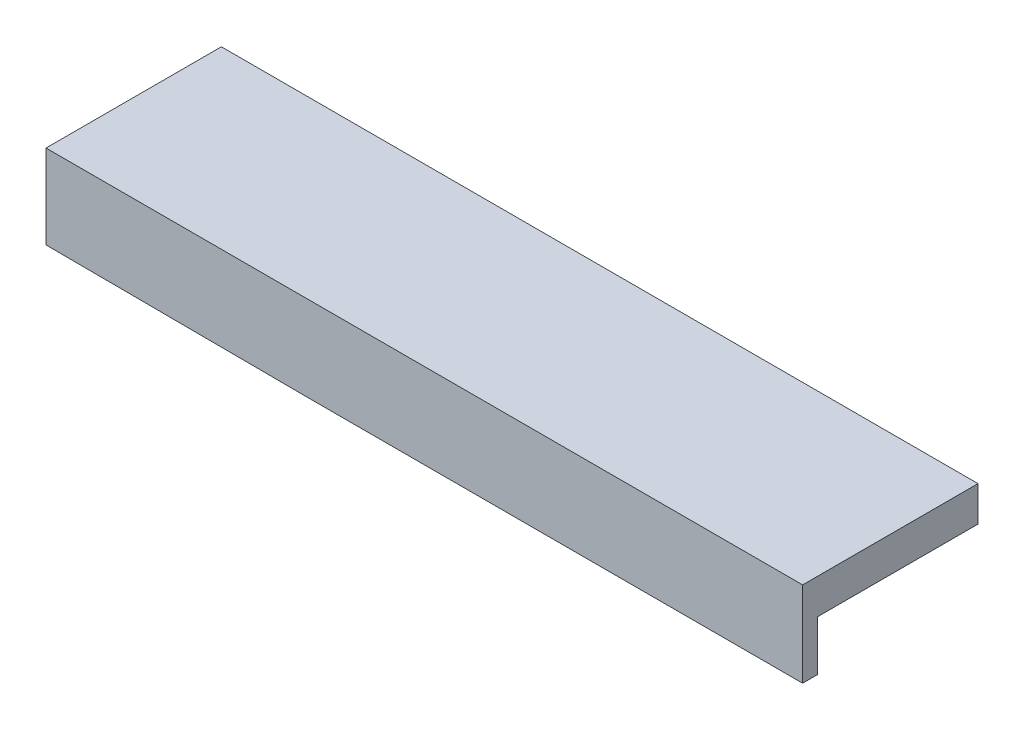
ISO-10303-21;
HEADER;
FILE_DESCRIPTION(('STEP AP214'),'2;1');
FILE_NAME('part.step','',(''),(''),'','','');
FILE_SCHEMA(('AUTOMOTIVE_DESIGN { 1 0 10303 214 1 1 1 1 }'));
ENDSEC;
DATA;
#1=APPLICATION_CONTEXT('core data for automotive mechanical design processes');
#2=APPLICATION_PROTOCOL_DEFINITION('international standard','automotive_design',2000,#1);
#3=PRODUCT_CONTEXT('',#1,'mechanical');
#4=PRODUCT('Part','Part','',(#3));
#5=PRODUCT_RELATED_PRODUCT_CATEGORY('part','',(#4));
#6=PRODUCT_DEFINITION_FORMATION('','',#4);
#7=PRODUCT_DEFINITION_CONTEXT('part definition',#1,'design');
#8=PRODUCT_DEFINITION('design','',#6,#7);
#9=PRODUCT_DEFINITION_SHAPE('','',#8);
#10=(LENGTH_UNIT() NAMED_UNIT(*) SI_UNIT(.MILLI.,.METRE.));
#11=(NAMED_UNIT(*) PLANE_ANGLE_UNIT() SI_UNIT($,.RADIAN.));
#12=(NAMED_UNIT(*) SI_UNIT($,.STERADIAN.) SOLID_ANGLE_UNIT());
#13=UNCERTAINTY_MEASURE_WITH_UNIT(LENGTH_MEASURE(1.E-05),#10,'distance_accuracy_value','');
#14=(GEOMETRIC_REPRESENTATION_CONTEXT(3) GLOBAL_UNCERTAINTY_ASSIGNED_CONTEXT((#13)) GLOBAL_UNIT_ASSIGNED_CONTEXT((#10,
#11,#12)) REPRESENTATION_CONTEXT('',''));
#15=CARTESIAN_POINT('',(0.,0.,0.));
#16=DIRECTION('',(0.,0.,1.));
#17=DIRECTION('',(1.,0.,0.));
#18=AXIS2_PLACEMENT_3D('',#15,#16,#17);
#19=CARTESIAN_POINT('',(23.15,-3.50000000000001,35.));
#20=DIRECTION('',(0.,1.,0.));
#21=DIRECTION('',(0.,0.,1.));
#22=AXIS2_PLACEMENT_3D('',#19,#20,#21);
#23=PLANE('',#22);
#24=DIRECTION('',(-1.,0.,0.));
#25=VECTOR('',#24,1.);
#26=CARTESIAN_POINT('',(85.9403065089106,-3.50000000000001,32.));
#27=LINE('',#26,#25);
#28=CARTESIAN_POINT('',(75.5,-3.50000000000001,32.));
#29=VERTEX_POINT('',#28);
#30=CARTESIAN_POINT('',(23.15,-3.50000000000001,32.));
#31=VERTEX_POINT('',#30);
#32=EDGE_CURVE('E167',#29,#31,#27,.T.);
#33=ORIENTED_EDGE('',*,*,#32,.T.);
#34=DIRECTION('',(0.,0.,-1.));
#35=VECTOR('',#34,1.);
#36=CARTESIAN_POINT('',(23.15,-3.50000000000001,35.));
#37=LINE('',#36,#35);
#38=CARTESIAN_POINT('',(23.15,-3.50000000000001,0.));
#39=VERTEX_POINT('',#38);
#40=EDGE_CURVE('E103',#31,#39,#37,.T.);
#41=ORIENTED_EDGE('',*,*,#40,.T.);
#42=DIRECTION('',(1.,0.,0.));
#43=VECTOR('',#42,1.);
#44=CARTESIAN_POINT('',(23.15,-3.50000000000001,0.));
#45=LINE('',#44,#43);
#46=CARTESIAN_POINT('',(75.5,-3.50000000000001,0.));
#47=VERTEX_POINT('',#46);
#48=EDGE_CURVE('E221',#39,#47,#45,.T.);
#49=ORIENTED_EDGE('',*,*,#48,.T.);
#50=DIRECTION('',(0.,0.,-1.));
#51=VECTOR('',#50,1.);
#52=CARTESIAN_POINT('',(75.5,-3.50000000000001,35.));
#53=LINE('',#52,#51);
#54=EDGE_CURVE('E12',#29,#47,#53,.T.);
#55=ORIENTED_EDGE('',*,*,#54,.F.);
#56=EDGE_LOOP('',(#33,#41,#49,#55));
#57=FACE_BOUND('',#56,.T.);
#58=ADVANCED_FACE('F38',(#57),#23,.F.);
#59=CARTESIAN_POINT('',(23.15,-13.5,35.));
#60=DIRECTION('',(-1.,0.,0.));
#61=DIRECTION('',(0.,0.,1.));
#62=AXIS2_PLACEMENT_3D('',#59,#60,#61);
#63=PLANE('',#62);
#64=DIRECTION('',(0.,1.,0.));
#65=VECTOR('',#64,1.);
#66=CARTESIAN_POINT('',(23.15,-3.50000000000001,32.));
#67=LINE('',#66,#65);
#68=CARTESIAN_POINT('',(23.15,-13.5,32.));
#69=VERTEX_POINT('',#68);
#70=EDGE_CURVE('E163',#69,#31,#67,.T.);
#71=ORIENTED_EDGE('',*,*,#70,.F.);
#72=DIRECTION('',(0.,0.,-1.));
#73=VECTOR('',#72,1.);
#74=CARTESIAN_POINT('',(23.15,-13.5,35.));
#75=LINE('',#74,#73);
#76=CARTESIAN_POINT('',(23.15,-13.5,0.));
#77=VERTEX_POINT('',#76);
#78=EDGE_CURVE('E96',#69,#77,#75,.T.);
#79=ORIENTED_EDGE('',*,*,#78,.T.);
#80=DIRECTION('',(0.,1.,0.));
#81=VECTOR('',#80,1.);
#82=CARTESIAN_POINT('',(23.15,-13.5,0.));
#83=LINE('',#82,#81);
#84=EDGE_CURVE('E242',#77,#39,#83,.T.);
#85=ORIENTED_EDGE('',*,*,#84,.T.);
#86=ORIENTED_EDGE('',*,*,#40,.F.);
#87=EDGE_LOOP('',(#71,#79,#85,#86));
#88=FACE_BOUND('',#87,.T.);
#89=ADVANCED_FACE('F169',(#88),#63,.F.);
#90=CARTESIAN_POINT('',(-75.5,-3.50000000000003,35.));
#91=DIRECTION('',(0.,1.,0.));
#92=DIRECTION('',(-1.,0.,0.));
#93=AXIS2_PLACEMENT_3D('',#90,#91,#92);
#94=PLANE('',#93);
#95=DIRECTION('',(1.,0.,0.));
#96=VECTOR('',#95,1.);
#97=CARTESIAN_POINT('',(-75.5,-3.50000000000003,32.));
#98=LINE('',#97,#96);
#99=CARTESIAN_POINT('',(-75.5,-3.50000000000003,32.));
#100=VERTEX_POINT('',#99);
#101=CARTESIAN_POINT('',(-23.1514578374667,-3.50000000000001,32.));
#102=VERTEX_POINT('',#101);
#103=EDGE_CURVE('E264',#100,#102,#98,.T.);
#104=ORIENTED_EDGE('',*,*,#103,.F.);
#105=DIRECTION('',(0.,0.,-1.));
#106=VECTOR('',#105,1.);
#107=CARTESIAN_POINT('',(-75.5,-3.50000000000003,35.));
#108=LINE('',#107,#106);
#109=CARTESIAN_POINT('',(-75.5,-3.50000000000003,0.));
#110=VERTEX_POINT('',#109);
#111=EDGE_CURVE('E196',#100,#110,#108,.T.);
#112=ORIENTED_EDGE('',*,*,#111,.T.);
#113=DIRECTION('',(1.,0.,0.));
#114=VECTOR('',#113,1.);
#115=CARTESIAN_POINT('',(-75.5,-3.50000000000003,0.));
#116=LINE('',#115,#114);
#117=CARTESIAN_POINT('',(-23.1514578374667,-3.50000000000001,0.));
#118=VERTEX_POINT('',#117);
#119=EDGE_CURVE('E219',#110,#118,#116,.T.);
#120=ORIENTED_EDGE('',*,*,#119,.T.);
#121=DIRECTION('',(0.,0.,-1.));
#122=VECTOR('',#121,1.);
#123=CARTESIAN_POINT('',(-23.1514578374667,-3.50000000000001,35.));
#124=LINE('',#123,#122);
#125=EDGE_CURVE('E194',#102,#118,#124,.T.);
#126=ORIENTED_EDGE('',*,*,#125,.F.);
#127=EDGE_LOOP('',(#104,#112,#120,#126));
#128=FACE_BOUND('',#127,.T.);
#129=ADVANCED_FACE('F299',(#128),#94,.F.);
#130=CARTESIAN_POINT('',(-23.1999999988432,-13.4998821822344,35.));
#131=DIRECTION('',(0.999988218223439,-0.0048542161376508,0.));
#132=DIRECTION('',(0.0048542161376508,0.99998821822344,0.));
#133=AXIS2_PLACEMENT_3D('',#130,#131,#132);
#134=PLANE('',#133);
#135=DIRECTION('',(-0.00485421613765073,-0.999988218223439,0.));
#136=VECTOR('',#135,1.);
#137=CARTESIAN_POINT('',(-23.1514578374667,-3.50000000000001,32.));
#138=LINE('',#137,#136);
#139=CARTESIAN_POINT('',(-23.1999999988432,-13.4998821822344,32.));
#140=VERTEX_POINT('',#139);
#141=EDGE_CURVE('E287',#102,#140,#138,.T.);
#142=ORIENTED_EDGE('',*,*,#141,.F.);
#143=ORIENTED_EDGE('',*,*,#125,.T.);
#144=DIRECTION('',(-0.0048542161376508,-0.999988218223439,0.));
#145=VECTOR('',#144,1.);
#146=CARTESIAN_POINT('',(-23.1999999988432,-13.4998821822344,0.));
#147=LINE('',#146,#145);
#148=CARTESIAN_POINT('',(-23.1999999988432,-13.4998821822344,0.));
#149=VERTEX_POINT('',#148);
#150=EDGE_CURVE('E227',#118,#149,#147,.T.);
#151=ORIENTED_EDGE('',*,*,#150,.T.);
#152=DIRECTION('',(0.,0.,-1.));
#153=VECTOR('',#152,1.);
#154=CARTESIAN_POINT('',(-23.1999999988432,-13.4998821822344,35.));
#155=LINE('',#154,#153);
#156=EDGE_CURVE('E190',#140,#149,#155,.T.);
#157=ORIENTED_EDGE('',*,*,#156,.F.);
#158=EDGE_LOOP('',(#142,#143,#151,#157));
#159=FACE_BOUND('',#158,.T.);
#160=ADVANCED_FACE('F304',(#159),#134,.F.);
#161=CARTESIAN_POINT('',(-17.15,-3.50000000000001,35.));
#162=DIRECTION('',(-0.99998750023437,0.00499993750117164,0.));
#163=DIRECTION('',(-0.00499993750117164,-0.99998750023437,0.));
#164=AXIS2_PLACEMENT_3D('',#161,#162,#163);
#165=PLANE('',#164);
#166=DIRECTION('',(-0.00499993750117164,-0.99998750023437,0.));
#167=VECTOR('',#166,1.);
#168=CARTESIAN_POINT('',(-17.1502616277533,-3.55232555066333,32.));
#169=LINE('',#168,#167);
#170=CARTESIAN_POINT('',(-17.15,-3.50000000000001,32.));
#171=VERTEX_POINT('',#170);
#172=CARTESIAN_POINT('',(-17.2,-13.5,32.));
#173=VERTEX_POINT('',#172);
#174=EDGE_CURVE('E253',#171,#173,#169,.T.);
#175=ORIENTED_EDGE('',*,*,#174,.T.);
#176=DIRECTION('',(0.,0.,-1.));
#177=VECTOR('',#176,1.);
#178=CARTESIAN_POINT('',(-17.2,-13.5,35.));
#179=LINE('',#178,#177);
#180=CARTESIAN_POINT('',(-17.2,-13.5,0.));
#181=VERTEX_POINT('',#180);
#182=EDGE_CURVE('E186',#173,#181,#179,.T.);
#183=ORIENTED_EDGE('',*,*,#182,.T.);
#184=DIRECTION('',(0.00499993750117164,0.99998750023437,0.));
#185=VECTOR('',#184,1.);
#186=CARTESIAN_POINT('',(-17.15,-3.50000000000001,0.));
#187=LINE('',#186,#185);
#188=CARTESIAN_POINT('',(-17.15,-3.50000000000001,0.));
#189=VERTEX_POINT('',#188);
#190=EDGE_CURVE('E233',#181,#189,#187,.T.);
#191=ORIENTED_EDGE('',*,*,#190,.T.);
#192=DIRECTION('',(0.,0.,-1.));
#193=VECTOR('',#192,1.);
#194=CARTESIAN_POINT('',(-17.15,-3.50000000000001,35.));
#195=LINE('',#194,#193);
#196=EDGE_CURVE('E184',#171,#189,#195,.T.);
#197=ORIENTED_EDGE('',*,*,#196,.F.);
#198=EDGE_LOOP('',(#175,#183,#191,#197));
#199=FACE_BOUND('',#198,.T.);
#200=ADVANCED_FACE('F321',(#199),#165,.F.);
#201=CARTESIAN_POINT('',(-17.15,-3.50000000000001,35.));
#202=DIRECTION('',(0.,1.,0.));
#203=DIRECTION('',(-1.,0.,0.));
#204=AXIS2_PLACEMENT_3D('',#201,#202,#203);
#205=PLANE('',#204);
#206=DIRECTION('',(1.,0.,0.));
#207=VECTOR('',#206,1.);
#208=CARTESIAN_POINT('',(-27.6153717604184,-3.50000000000001,32.));
#209=LINE('',#208,#207);
#210=CARTESIAN_POINT('',(17.15,-3.50000000000001,32.));
#211=VERTEX_POINT('',#210);
#212=EDGE_CURVE('E263',#171,#211,#209,.T.);
#213=ORIENTED_EDGE('',*,*,#212,.F.);
#214=ORIENTED_EDGE('',*,*,#196,.T.);
#215=DIRECTION('',(1.,0.,0.));
#216=VECTOR('',#215,1.);
#217=CARTESIAN_POINT('',(-17.15,-3.50000000000001,0.));
#218=LINE('',#217,#216);
#219=CARTESIAN_POINT('',(17.15,-3.50000000000001,0.));
#220=VERTEX_POINT('',#219);
#221=EDGE_CURVE('E236',#189,#220,#218,.T.);
#222=ORIENTED_EDGE('',*,*,#221,.T.);
#223=DIRECTION('',(0.,0.,-1.));
#224=VECTOR('',#223,1.);
#225=CARTESIAN_POINT('',(17.15,-3.50000000000001,35.));
#226=LINE('',#225,#224);
#227=EDGE_CURVE('E177',#211,#220,#226,.T.);
#228=ORIENTED_EDGE('',*,*,#227,.F.);
#229=EDGE_LOOP('',(#213,#214,#222,#228));
#230=FACE_BOUND('',#229,.T.);
#231=ADVANCED_FACE('F317',(#230),#205,.F.);
#232=CARTESIAN_POINT('',(17.15,-3.50000000000001,35.));
#233=DIRECTION('',(1.,0.,0.));
#234=DIRECTION('',(0.,1.,0.));
#235=AXIS2_PLACEMENT_3D('',#232,#233,#234);
#236=PLANE('',#235);
#237=DIRECTION('',(0.,-1.,0.));
#238=VECTOR('',#237,1.);
#239=CARTESIAN_POINT('',(17.15,-3.50000000000001,32.));
#240=LINE('',#239,#238);
#241=CARTESIAN_POINT('',(17.15,-13.5,32.));
#242=VERTEX_POINT('',#241);
#243=EDGE_CURVE('E260',#211,#242,#240,.T.);
#244=ORIENTED_EDGE('',*,*,#243,.F.);
#245=ORIENTED_EDGE('',*,*,#227,.T.);
#246=DIRECTION('',(0.,-1.,0.));
#247=VECTOR('',#246,1.);
#248=CARTESIAN_POINT('',(17.15,-3.50000000000001,0.));
#249=LINE('',#248,#247);
#250=CARTESIAN_POINT('',(17.15,-13.5,0.));
#251=VERTEX_POINT('',#250);
#252=EDGE_CURVE('E239',#220,#251,#249,.T.);
#253=ORIENTED_EDGE('',*,*,#252,.T.);
#254=DIRECTION('',(0.,0.,-1.));
#255=VECTOR('',#254,1.);
#256=CARTESIAN_POINT('',(17.15,-13.5,35.));
#257=LINE('',#256,#255);
#258=EDGE_CURVE('E175',#242,#251,#257,.T.);
#259=ORIENTED_EDGE('',*,*,#258,.F.);
#260=EDGE_LOOP('',(#244,#245,#253,#259));
#261=FACE_BOUND('',#260,.T.);
#262=ADVANCED_FACE('F314',(#261),#236,.F.);
#263=CARTESIAN_POINT('',(75.5,3.49999999999999,35.));
#264=DIRECTION('',(-1.,0.,0.));
#265=DIRECTION('',(0.,0.,1.));
#266=AXIS2_PLACEMENT_3D('',#263,#264,#265);
#267=PLANE('',#266);
#268=DIRECTION('',(0.,1.,0.));
#269=VECTOR('',#268,1.);
#270=CARTESIAN_POINT('',(75.5,3.49999999999999,0.));
#271=LINE('',#270,#269);
#272=CARTESIAN_POINT('',(75.5,3.49999999999999,0.));
#273=VERTEX_POINT('',#272);
#274=EDGE_CURVE('E214',#47,#273,#271,.T.);
#275=ORIENTED_EDGE('',*,*,#274,.T.);
#276=DIRECTION('',(0.,0.,-1.));
#277=VECTOR('',#276,1.);
#278=CARTESIAN_POINT('',(75.5,3.49999999999999,35.));
#279=LINE('',#278,#277);
#280=CARTESIAN_POINT('',(75.5,3.49999999999999,35.));
#281=VERTEX_POINT('',#280);
#282=EDGE_CURVE('E46',#281,#273,#279,.T.);
#283=ORIENTED_EDGE('',*,*,#282,.F.);
#284=DIRECTION('',(0.,1.,0.));
#285=VECTOR('',#284,1.);
#286=CARTESIAN_POINT('',(75.5,3.49999999999999,35.));
#287=LINE('',#286,#285);
#288=CARTESIAN_POINT('',(75.5,-13.5,35.));
#289=VERTEX_POINT('',#288);
#290=EDGE_CURVE('E107',#289,#281,#287,.T.);
#291=ORIENTED_EDGE('',*,*,#290,.F.);
#292=DIRECTION('',(0.,0.,1.));
#293=VECTOR('',#292,1.);
#294=CARTESIAN_POINT('',(75.5,-13.5,35.));
#295=LINE('',#294,#293);
#296=CARTESIAN_POINT('',(75.5,-13.5,32.));
#297=VERTEX_POINT('',#296);
#298=EDGE_CURVE('E290',#297,#289,#295,.T.);
#299=ORIENTED_EDGE('',*,*,#298,.F.);
#300=DIRECTION('',(0.,-1.,0.));
#301=VECTOR('',#300,1.);
#302=CARTESIAN_POINT('',(75.5,-3.50000000000001,32.));
#303=LINE('',#302,#301);
#304=EDGE_CURVE('E164',#29,#297,#303,.T.);
#305=ORIENTED_EDGE('',*,*,#304,.F.);
#306=ORIENTED_EDGE('',*,*,#54,.T.);
#307=EDGE_LOOP('',(#275,#283,#291,#299,#305,#306));
#308=FACE_BOUND('',#307,.T.);
#309=ADVANCED_FACE('F294',(#308),#267,.F.);
#310=CARTESIAN_POINT('',(-75.5,3.50000000000001,35.));
#311=DIRECTION('',(0.,-1.,0.));
#312=DIRECTION('',(1.,0.,0.));
#313=AXIS2_PLACEMENT_3D('',#310,#311,#312);
#314=PLANE('',#313);
#315=DIRECTION('',(-1.,0.,0.));
#316=VECTOR('',#315,1.);
#317=CARTESIAN_POINT('',(-75.5,3.50000000000001,0.));
#318=LINE('',#317,#316);
#319=CARTESIAN_POINT('',(-75.5,3.50000000000001,0.));
#320=VERTEX_POINT('',#319);
#321=EDGE_CURVE('E206',#273,#320,#318,.T.);
#322=ORIENTED_EDGE('',*,*,#321,.T.);
#323=DIRECTION('',(0.,0.,-1.));
#324=VECTOR('',#323,1.);
#325=CARTESIAN_POINT('',(-75.5,3.50000000000001,35.));
#326=LINE('',#325,#324);
#327=CARTESIAN_POINT('',(-75.5,3.50000000000001,35.));
#328=VERTEX_POINT('',#327);
#329=EDGE_CURVE('E198',#328,#320,#326,.T.);
#330=ORIENTED_EDGE('',*,*,#329,.F.);
#331=DIRECTION('',(-1.,0.,0.));
#332=VECTOR('',#331,1.);
#333=CARTESIAN_POINT('',(-75.5,3.50000000000001,35.));
#334=LINE('',#333,#332);
#335=EDGE_CURVE('E207',#281,#328,#334,.T.);
#336=ORIENTED_EDGE('',*,*,#335,.F.);
#337=ORIENTED_EDGE('',*,*,#282,.T.);
#338=EDGE_LOOP('',(#322,#330,#336,#337));
#339=FACE_BOUND('',#338,.T.);
#340=ADVANCED_FACE('F204',(#339),#314,.F.);
#341=CARTESIAN_POINT('',(-75.5,3.50000000000001,35.));
#342=DIRECTION('',(1.,0.,0.));
#343=DIRECTION('',(0.,0.,-1.));
#344=AXIS2_PLACEMENT_3D('',#341,#342,#343);
#345=PLANE('',#344);
#346=ORIENTED_EDGE('',*,*,#111,.F.);
#347=DIRECTION('',(0.,1.,0.));
#348=VECTOR('',#347,1.);
#349=CARTESIAN_POINT('',(-75.5,-3.19532333709247,32.));
#350=LINE('',#349,#348);
#351=CARTESIAN_POINT('',(-75.5,-13.2461215076318,32.));
#352=VERTEX_POINT('',#351);
#353=EDGE_CURVE('E269',#352,#100,#350,.T.);
#354=ORIENTED_EDGE('',*,*,#353,.F.);
#355=DIRECTION('',(0.,0.,-1.));
#356=VECTOR('',#355,1.);
#357=CARTESIAN_POINT('',(-75.5,-13.2461215076318,35.));
#358=LINE('',#357,#356);
#359=CARTESIAN_POINT('',(-75.5,-13.2461215076318,35.));
#360=VERTEX_POINT('',#359);
#361=EDGE_CURVE('E274',#360,#352,#358,.T.);
#362=ORIENTED_EDGE('',*,*,#361,.F.);
#363=DIRECTION('',(0.,-1.,0.));
#364=VECTOR('',#363,1.);
#365=CARTESIAN_POINT('',(-75.5,3.50000000000001,35.));
#366=LINE('',#365,#364);
#367=EDGE_CURVE('E244',#328,#360,#366,.T.);
#368=ORIENTED_EDGE('',*,*,#367,.F.);
#369=ORIENTED_EDGE('',*,*,#329,.T.);
#370=DIRECTION('',(0.,-1.,0.));
#371=VECTOR('',#370,1.);
#372=CARTESIAN_POINT('',(-75.5,3.50000000000001,0.));
#373=LINE('',#372,#371);
#374=EDGE_CURVE('E217',#320,#110,#373,.T.);
#375=ORIENTED_EDGE('',*,*,#374,.T.);
#376=EDGE_LOOP('',(#346,#354,#362,#368,#369,#375));
#377=FACE_BOUND('',#376,.T.);
#378=ADVANCED_FACE('F327',(#377),#345,.F.);
#379=CARTESIAN_POINT('',(-17.2,-13.5,35.));
#380=DIRECTION('',(1.96362942699961E-05,0.999999999807208,0.));
#381=DIRECTION('',(-0.999999999807208,1.96362942699961E-05,0.));
#382=AXIS2_PLACEMENT_3D('',#379,#380,#381);
#383=PLANE('',#382);
#384=DIRECTION('',(0.999999999807208,-1.96362942699961E-05,0.));
#385=VECTOR('',#384,1.);
#386=CARTESIAN_POINT('',(-17.2,-13.5,0.));
#387=LINE('',#386,#385);
#388=EDGE_CURVE('E230',#149,#181,#387,.T.);
#389=ORIENTED_EDGE('',*,*,#388,.T.);
#390=ORIENTED_EDGE('',*,*,#182,.F.);
#391=CARTESIAN_POINT('',(-17.2,-13.5,35.));
#392=VERTEX_POINT('',#391);
#393=EDGE_CURVE('E187',#392,#173,#179,.T.);
#394=ORIENTED_EDGE('',*,*,#393,.F.);
#395=DIRECTION('',(0.999999999807208,-1.96362942699961E-05,0.));
#396=VECTOR('',#395,1.);
#397=CARTESIAN_POINT('',(-17.2,-13.5,35.));
#398=LINE('',#397,#396);
#399=CARTESIAN_POINT('',(-23.1999999988432,-13.4998821822344,35.));
#400=VERTEX_POINT('',#399);
#401=EDGE_CURVE('E251',#400,#392,#398,.T.);
#402=ORIENTED_EDGE('',*,*,#401,.F.);
#403=EDGE_CURVE('E191',#400,#140,#155,.T.);
#404=ORIENTED_EDGE('',*,*,#403,.T.);
#405=ORIENTED_EDGE('',*,*,#156,.T.);
#406=EDGE_LOOP('',(#389,#390,#394,#402,#404,#405));
#407=FACE_BOUND('',#406,.T.);
#408=ADVANCED_FACE('F313',(#407),#383,.F.);
#409=CARTESIAN_POINT('',(17.15,-13.5,35.));
#410=DIRECTION('',(0.,1.,0.));
#411=DIRECTION('',(0.,0.,1.));
#412=AXIS2_PLACEMENT_3D('',#409,#410,#411);
#413=PLANE('',#412);
#414=DIRECTION('',(1.,0.,0.));
#415=VECTOR('',#414,1.);
#416=CARTESIAN_POINT('',(17.15,-13.5,0.));
#417=LINE('',#416,#415);
#418=EDGE_CURVE('E173',#251,#77,#417,.T.);
#419=ORIENTED_EDGE('',*,*,#418,.T.);
#420=ORIENTED_EDGE('',*,*,#78,.F.);
#421=DIRECTION('',(-1.,0.,0.));
#422=VECTOR('',#421,1.);
#423=CARTESIAN_POINT('',(85.9403065089106,-13.5,32.));
#424=LINE('',#423,#422);
#425=EDGE_CURVE('E160',#297,#69,#424,.T.);
#426=ORIENTED_EDGE('',*,*,#425,.F.);
#427=ORIENTED_EDGE('',*,*,#298,.T.);
#428=DIRECTION('',(1.,0.,0.));
#429=VECTOR('',#428,1.);
#430=CARTESIAN_POINT('',(17.15,-13.5,35.));
#431=LINE('',#430,#429);
#432=EDGE_CURVE('E179',#392,#289,#431,.T.);
#433=ORIENTED_EDGE('',*,*,#432,.F.);
#434=ORIENTED_EDGE('',*,*,#393,.T.);
#435=DIRECTION('',(1.,0.,0.));
#436=VECTOR('',#435,1.);
#437=CARTESIAN_POINT('',(-27.6153717604184,-13.5,32.));
#438=LINE('',#437,#436);
#439=EDGE_CURVE('E247',#173,#242,#438,.T.);
#440=ORIENTED_EDGE('',*,*,#439,.T.);
#441=ORIENTED_EDGE('',*,*,#258,.T.);
#442=EDGE_LOOP('',(#419,#420,#426,#427,#433,#434,#440,#441));
#443=FACE_BOUND('',#442,.T.);
#444=ADVANCED_FACE('F171',(#443),#413,.F.);
#445=CARTESIAN_POINT('',(0.,0.,35.));
#446=DIRECTION('',(0.,0.,-1.));
#447=DIRECTION('',(-1.,0.,0.));
#448=AXIS2_PLACEMENT_3D('',#445,#446,#447);
#449=PLANE('',#448);
#450=ORIENTED_EDGE('',*,*,#367,.T.);
#451=DIRECTION('',(0.999988218223439,-0.00485421613765081,0.));
#452=VECTOR('',#451,1.);
#453=CARTESIAN_POINT('',(-85.9646292225518,-13.1953233370925,35.));
#454=LINE('',#453,#452);
#455=CARTESIAN_POINT('',(-23.2000005707629,-13.5,35.));
#456=VERTEX_POINT('',#455);
#457=EDGE_CURVE('E282',#360,#456,#454,.T.);
#458=ORIENTED_EDGE('',*,*,#457,.T.);
#459=DIRECTION('',(0.00485421613765073,0.999988218223439,0.));
#460=VECTOR('',#459,1.);
#461=CARTESIAN_POINT('',(-23.1514578374667,-3.50000000000001,35.));
#462=LINE('',#461,#460);
#463=EDGE_CURVE('E54',#456,#400,#462,.T.);
#464=ORIENTED_EDGE('',*,*,#463,.T.);
#465=ORIENTED_EDGE('',*,*,#401,.T.);
#466=ORIENTED_EDGE('',*,*,#432,.T.);
#467=ORIENTED_EDGE('',*,*,#290,.T.);
#468=ORIENTED_EDGE('',*,*,#335,.T.);
#469=EDGE_LOOP('',(#450,#458,#464,#465,#466,#467,#468));
#470=FACE_BOUND('',#469,.T.);
#471=ADVANCED_FACE('F312',(#470),#449,.F.);
#472=CARTESIAN_POINT('',(0.,0.,0.));
#473=DIRECTION('',(0.,0.,-1.));
#474=DIRECTION('',(-1.,0.,0.));
#475=AXIS2_PLACEMENT_3D('',#472,#473,#474);
#476=PLANE('',#475);
#477=ORIENTED_EDGE('',*,*,#48,.F.);
#478=ORIENTED_EDGE('',*,*,#84,.F.);
#479=ORIENTED_EDGE('',*,*,#418,.F.);
#480=ORIENTED_EDGE('',*,*,#252,.F.);
#481=ORIENTED_EDGE('',*,*,#221,.F.);
#482=ORIENTED_EDGE('',*,*,#190,.F.);
#483=ORIENTED_EDGE('',*,*,#388,.F.);
#484=ORIENTED_EDGE('',*,*,#150,.F.);
#485=ORIENTED_EDGE('',*,*,#119,.F.);
#486=ORIENTED_EDGE('',*,*,#374,.F.);
#487=ORIENTED_EDGE('',*,*,#321,.F.);
#488=ORIENTED_EDGE('',*,*,#274,.F.);
#489=EDGE_LOOP('',(#477,#478,#479,#480,#481,#482,#483,#484,#485,#486,#487,#488));
#490=FACE_BOUND('',#489,.T.);
#491=ADVANCED_FACE('F213',(#490),#476,.T.);
#492=CARTESIAN_POINT('',(-27.6153717604184,-3.50000000000001,32.));
#493=DIRECTION('',(0.,0.,1.));
#494=DIRECTION('',(1.,0.,0.));
#495=AXIS2_PLACEMENT_3D('',#492,#493,#494);
#496=PLANE('',#495);
#497=ORIENTED_EDGE('',*,*,#174,.F.);
#498=ORIENTED_EDGE('',*,*,#212,.T.);
#499=ORIENTED_EDGE('',*,*,#243,.T.);
#500=ORIENTED_EDGE('',*,*,#439,.F.);
#501=EDGE_LOOP('',(#497,#498,#499,#500));
#502=FACE_BOUND('',#501,.T.);
#503=ADVANCED_FACE('F371',(#502),#496,.F.);
#504=CARTESIAN_POINT('',(-85.9160864892557,-3.19532333709247,32.));
#505=DIRECTION('',(0.,0.,1.));
#506=DIRECTION('',(1.,0.,0.));
#507=AXIS2_PLACEMENT_3D('',#504,#505,#506);
#508=PLANE('',#507);
#509=ORIENTED_EDGE('',*,*,#353,.T.);
#510=ORIENTED_EDGE('',*,*,#103,.T.);
#511=ORIENTED_EDGE('',*,*,#141,.T.);
#512=CARTESIAN_POINT('',(-23.2000005707629,-13.5,32.));
#513=VERTEX_POINT('',#512);
#514=EDGE_CURVE('E289',#140,#513,#138,.T.);
#515=ORIENTED_EDGE('',*,*,#514,.T.);
#516=DIRECTION('',(0.999988218223439,-0.00485421613765081,0.));
#517=VECTOR('',#516,1.);
#518=CARTESIAN_POINT('',(-85.9646292225518,-13.1953233370925,32.));
#519=LINE('',#518,#517);
#520=EDGE_CURVE('E279',#352,#513,#519,.T.);
#521=ORIENTED_EDGE('',*,*,#520,.F.);
#522=EDGE_LOOP('',(#509,#510,#511,#515,#521));
#523=FACE_BOUND('',#522,.T.);
#524=ADVANCED_FACE('F378',(#523),#508,.F.);
#525=CARTESIAN_POINT('',(-23.1339227537616,0.112298384232946,0.));
#526=DIRECTION('',(0.999988218223439,-0.00485421613765073,0.));
#527=DIRECTION('',(0.00485421613765073,0.999988218223439,0.));
#528=AXIS2_PLACEMENT_3D('',#525,#526,#527);
#529=PLANE('',#528);
#530=ORIENTED_EDGE('',*,*,#403,.F.);
#531=ORIENTED_EDGE('',*,*,#463,.F.);
#532=DIRECTION('',(0.,0.,1.));
#533=VECTOR('',#532,1.);
#534=CARTESIAN_POINT('',(-23.2000005707629,-13.5,35.));
#535=LINE('',#534,#533);
#536=EDGE_CURVE('E284',#513,#456,#535,.T.);
#537=ORIENTED_EDGE('',*,*,#536,.F.);
#538=ORIENTED_EDGE('',*,*,#514,.F.);
#539=EDGE_LOOP('',(#530,#531,#537,#538));
#540=FACE_BOUND('',#539,.T.);
#541=ADVANCED_FACE('F385',(#540),#529,.T.);
#542=CARTESIAN_POINT('',(-85.9646292225518,-13.1953233370925,35.));
#543=DIRECTION('',(0.00485421613765081,0.999988218223439,0.));
#544=DIRECTION('',(-0.999988218223439,0.00485421613765081,0.));
#545=AXIS2_PLACEMENT_3D('',#542,#543,#544);
#546=PLANE('',#545);
#547=ORIENTED_EDGE('',*,*,#457,.F.);
#548=ORIENTED_EDGE('',*,*,#361,.T.);
#549=ORIENTED_EDGE('',*,*,#520,.T.);
#550=ORIENTED_EDGE('',*,*,#536,.T.);
#551=EDGE_LOOP('',(#547,#548,#549,#550));
#552=FACE_BOUND('',#551,.T.);
#553=ADVANCED_FACE('F392',(#552),#546,.F.);
#554=CARTESIAN_POINT('',(85.9403065089106,-3.50000000000001,32.));
#555=DIRECTION('',(0.,0.,1.));
#556=DIRECTION('',(1.,0.,0.));
#557=AXIS2_PLACEMENT_3D('',#554,#555,#556);
#558=PLANE('',#557);
#559=ORIENTED_EDGE('',*,*,#32,.F.);
#560=ORIENTED_EDGE('',*,*,#304,.T.);
#561=ORIENTED_EDGE('',*,*,#425,.T.);
#562=ORIENTED_EDGE('',*,*,#70,.T.);
#563=EDGE_LOOP('',(#559,#560,#561,#562));
#564=FACE_BOUND('',#563,.T.);
#565=ADVANCED_FACE('F162',(#564),#558,.F.);
#566=CLOSED_SHELL('',(#58,#89,#129,#160,#200,#231,#262,#309,#340,#378,#408,#444,#471,#491,#503,
#524,#541,#553,#565));
#567=MANIFOLD_SOLID_BREP('B2',#566);
#568=ADVANCED_BREP_SHAPE_REPRESENTATION('',(#18,#567),#14);
#569=SHAPE_DEFINITION_REPRESENTATION(#9,#568);
ENDSEC;
END-ISO-10303-21;
